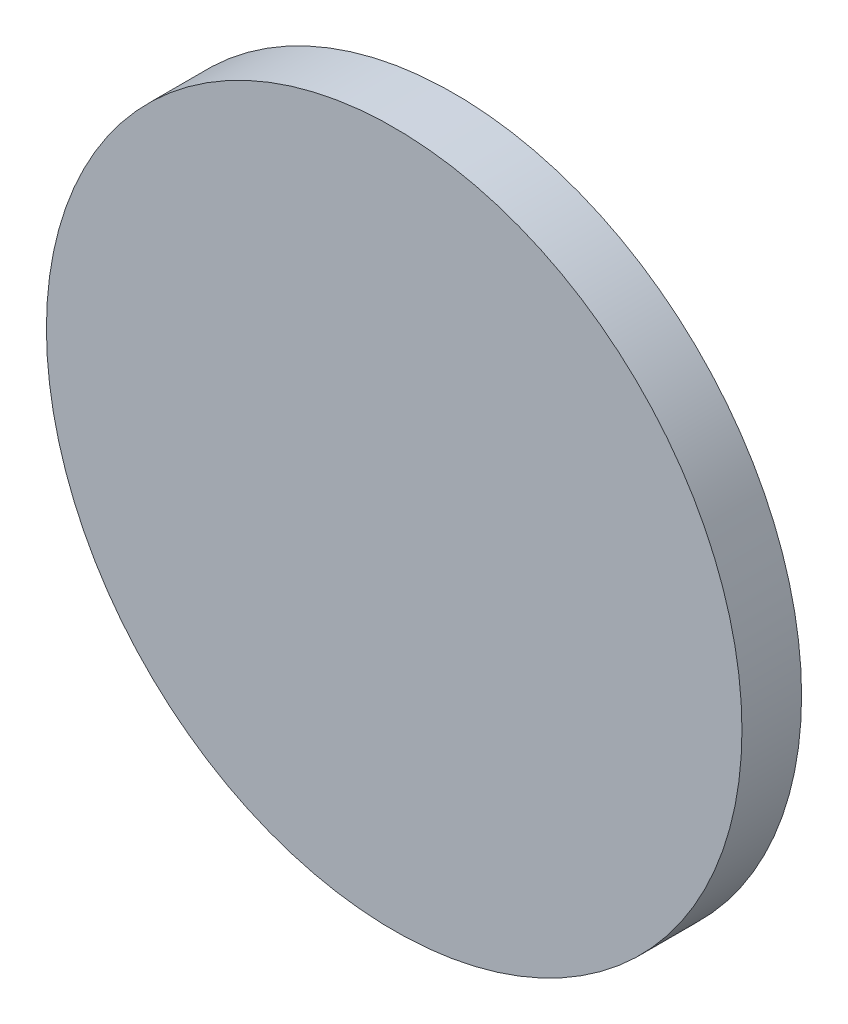
ISO-10303-21;
HEADER;
FILE_DESCRIPTION(('STEP AP214'),'2;1');
FILE_NAME('part.step','',(''),(''),'','','');
FILE_SCHEMA(('AUTOMOTIVE_DESIGN { 1 0 10303 214 1 1 1 1 }'));
ENDSEC;
DATA;
#1=APPLICATION_CONTEXT('core data for automotive mechanical design processes');
#2=APPLICATION_PROTOCOL_DEFINITION('international standard','automotive_design',2000,#1);
#3=PRODUCT_CONTEXT('',#1,'mechanical');
#4=PRODUCT('Part','Part','',(#3));
#5=PRODUCT_RELATED_PRODUCT_CATEGORY('part','',(#4));
#6=PRODUCT_DEFINITION_FORMATION('','',#4);
#7=PRODUCT_DEFINITION_CONTEXT('part definition',#1,'design');
#8=PRODUCT_DEFINITION('design','',#6,#7);
#9=PRODUCT_DEFINITION_SHAPE('','',#8);
#10=(LENGTH_UNIT() NAMED_UNIT(*) SI_UNIT(.MILLI.,.METRE.));
#11=(NAMED_UNIT(*) PLANE_ANGLE_UNIT() SI_UNIT($,.RADIAN.));
#12=(NAMED_UNIT(*) SI_UNIT($,.STERADIAN.) SOLID_ANGLE_UNIT());
#13=UNCERTAINTY_MEASURE_WITH_UNIT(LENGTH_MEASURE(1.E-05),#10,'distance_accuracy_value','');
#14=(GEOMETRIC_REPRESENTATION_CONTEXT(3) GLOBAL_UNCERTAINTY_ASSIGNED_CONTEXT((#13)) GLOBAL_UNIT_ASSIGNED_CONTEXT((#10,
#11,#12)) REPRESENTATION_CONTEXT('',''));
#15=CARTESIAN_POINT('',(0.,0.,0.));
#16=DIRECTION('',(0.,0.,1.));
#17=DIRECTION('',(1.,0.,0.));
#18=AXIS2_PLACEMENT_3D('',#15,#16,#17);
#19=CARTESIAN_POINT('',(1.30008,10.900000006176,0.76487));
#20=DIRECTION('',(0.,0.,-1.));
#21=DIRECTION('',(-1.,0.,0.));
#22=AXIS2_PLACEMENT_3D('',#19,#20,#21);
#23=PLANE('',#22);
#24=CARTESIAN_POINT('',(1.30008,10.900000006176,0.76487));
#25=DIRECTION('',(0.,0.,1.));
#26=DIRECTION('',(1.,0.,0.));
#27=AXIS2_PLACEMENT_3D('',#24,#25,#26);
#28=CIRCLE('',#27,0.200024667);
#29=CARTESIAN_POINT('',(1.500104667,10.900000006176,0.76487));
#30=VERTEX_POINT('',#29);
#31=EDGE_CURVE('E18',#30,#30,#28,.T.);
#32=ORIENTED_EDGE('',*,*,#31,.F.);
#33=EDGE_LOOP('',(#32));
#34=FACE_BOUND('',#33,.T.);
#35=ADVANCED_FACE('F15',(#34),#23,.T.);
#36=CARTESIAN_POINT('',(1.30008,10.900000006176,0.76487));
#37=DIRECTION('',(0.,0.,1.));
#38=DIRECTION('',(1.,0.,0.));
#39=AXIS2_PLACEMENT_3D('',#36,#37,#38);
#40=CYLINDRICAL_SURFACE('',#39,0.200024667);
#41=CARTESIAN_POINT('',(1.30008,10.900000006176,0.79916));
#42=DIRECTION('',(0.,0.,1.));
#43=DIRECTION('',(1.,0.,0.));
#44=AXIS2_PLACEMENT_3D('',#41,#42,#43);
#45=CIRCLE('',#44,0.200024667);
#46=CARTESIAN_POINT('',(1.500104667,10.900000006176,0.79916));
#47=VERTEX_POINT('',#46);
#48=EDGE_CURVE('E10',#47,#47,#45,.T.);
#49=ORIENTED_EDGE('',*,*,#48,.F.);
#50=EDGE_LOOP('',(#49));
#51=FACE_BOUND('',#50,.T.);
#52=ORIENTED_EDGE('',*,*,#31,.T.);
#53=EDGE_LOOP('',(#52));
#54=FACE_BOUND('',#53,.T.);
#55=ADVANCED_FACE('F27',(#51,#54),#40,.T.);
#56=CARTESIAN_POINT('',(1.30008,10.900000006176,0.79916));
#57=DIRECTION('',(0.,0.,1.));
#58=DIRECTION('',(1.,0.,0.));
#59=AXIS2_PLACEMENT_3D('',#56,#57,#58);
#60=PLANE('',#59);
#61=ORIENTED_EDGE('',*,*,#48,.T.);
#62=EDGE_LOOP('',(#61));
#63=FACE_BOUND('',#62,.T.);
#64=ADVANCED_FACE('F34',(#63),#60,.T.);
#65=CLOSED_SHELL('',(#35,#55,#64));
#66=MANIFOLD_SOLID_BREP('B1',#65);
#67=ADVANCED_BREP_SHAPE_REPRESENTATION('',(#18,#66),#14);
#68=SHAPE_DEFINITION_REPRESENTATION(#9,#67);
ENDSEC;
END-ISO-10303-21;
